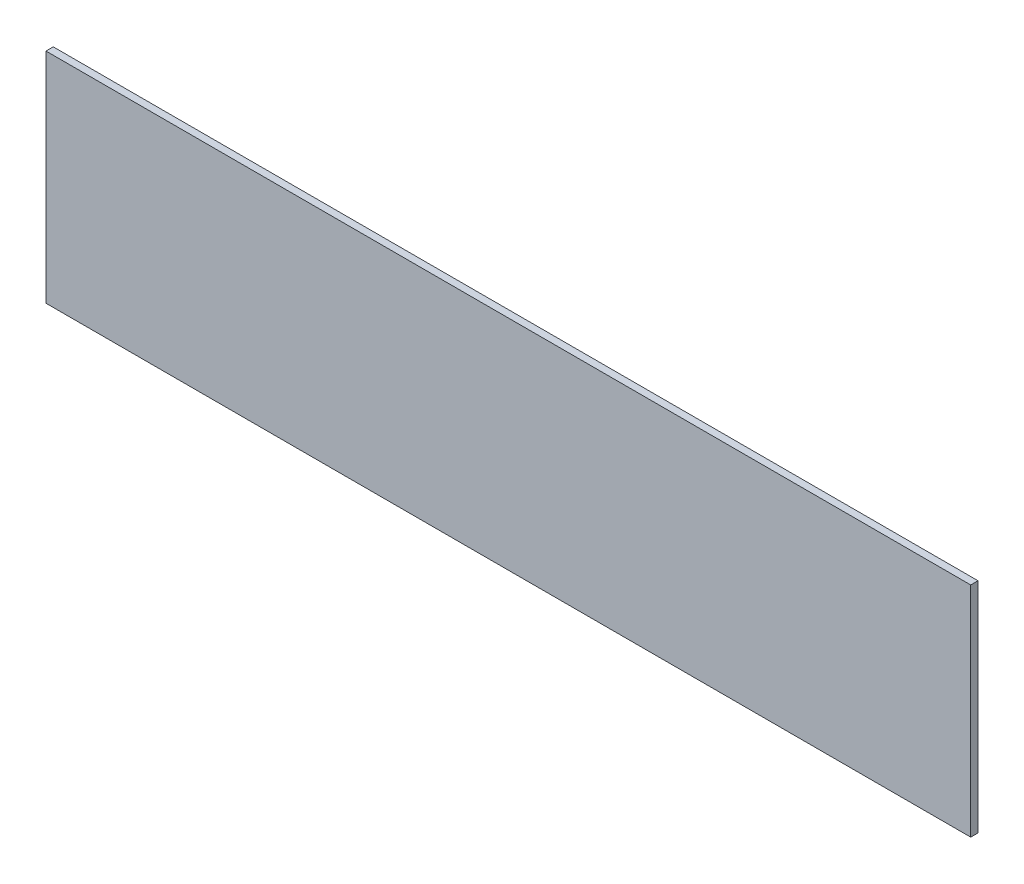
ISO-10303-21;
HEADER;
FILE_DESCRIPTION(('STEP AP214'),'2;1');
FILE_NAME('part.step','',(''),(''),'','','');
FILE_SCHEMA(('AUTOMOTIVE_DESIGN { 1 0 10303 214 1 1 1 1 }'));
ENDSEC;
DATA;
#1=APPLICATION_CONTEXT('core data for automotive mechanical design processes');
#2=APPLICATION_PROTOCOL_DEFINITION('international standard','automotive_design',2000,#1);
#3=PRODUCT_CONTEXT('',#1,'mechanical');
#4=PRODUCT('Part','Part','',(#3));
#5=PRODUCT_RELATED_PRODUCT_CATEGORY('part','',(#4));
#6=PRODUCT_DEFINITION_FORMATION('','',#4);
#7=PRODUCT_DEFINITION_CONTEXT('part definition',#1,'design');
#8=PRODUCT_DEFINITION('design','',#6,#7);
#9=PRODUCT_DEFINITION_SHAPE('','',#8);
#10=(LENGTH_UNIT() NAMED_UNIT(*) SI_UNIT(.MILLI.,.METRE.));
#11=(NAMED_UNIT(*) PLANE_ANGLE_UNIT() SI_UNIT($,.RADIAN.));
#12=(NAMED_UNIT(*) SI_UNIT($,.STERADIAN.) SOLID_ANGLE_UNIT());
#13=UNCERTAINTY_MEASURE_WITH_UNIT(LENGTH_MEASURE(1.E-05),#10,'distance_accuracy_value','');
#14=(GEOMETRIC_REPRESENTATION_CONTEXT(3) GLOBAL_UNCERTAINTY_ASSIGNED_CONTEXT((#13)) GLOBAL_UNIT_ASSIGNED_CONTEXT((#10,
#11,#12)) REPRESENTATION_CONTEXT('',''));
#15=CARTESIAN_POINT('',(0.,0.,0.));
#16=DIRECTION('',(0.,0.,1.));
#17=DIRECTION('',(1.,0.,0.));
#18=AXIS2_PLACEMENT_3D('',#15,#16,#17);
#19=CARTESIAN_POINT('',(-95.25,-22.5,1.5));
#20=DIRECTION('',(1.,0.,0.));
#21=DIRECTION('',(0.,0.,-1.));
#22=AXIS2_PLACEMENT_3D('',#19,#20,#21);
#23=PLANE('',#22);
#24=DIRECTION('',(0.,-1.,0.));
#25=VECTOR('',#24,1.);
#26=CARTESIAN_POINT('',(-95.25,-22.5,0.));
#27=LINE('',#26,#25);
#28=CARTESIAN_POINT('',(-95.25,22.5,0.));
#29=VERTEX_POINT('',#28);
#30=CARTESIAN_POINT('',(-95.25,-22.5,0.));
#31=VERTEX_POINT('',#30);
#32=EDGE_CURVE('E96',#29,#31,#27,.T.);
#33=ORIENTED_EDGE('',*,*,#32,.T.);
#34=DIRECTION('',(0.,0.,-1.));
#35=VECTOR('',#34,1.);
#36=CARTESIAN_POINT('',(-95.25,-22.5,1.5));
#37=LINE('',#36,#35);
#38=CARTESIAN_POINT('',(-95.25,-22.5,1.5));
#39=VERTEX_POINT('',#38);
#40=EDGE_CURVE('E11',#39,#31,#37,.T.);
#41=ORIENTED_EDGE('',*,*,#40,.F.);
#42=DIRECTION('',(0.,-1.,0.));
#43=VECTOR('',#42,1.);
#44=CARTESIAN_POINT('',(-95.25,-22.5,1.5));
#45=LINE('',#44,#43);
#46=CARTESIAN_POINT('',(-95.25,22.5,1.5));
#47=VERTEX_POINT('',#46);
#48=EDGE_CURVE('E84',#47,#39,#45,.T.);
#49=ORIENTED_EDGE('',*,*,#48,.F.);
#50=DIRECTION('',(0.,0.,-1.));
#51=VECTOR('',#50,1.);
#52=CARTESIAN_POINT('',(-95.25,22.5,1.5));
#53=LINE('',#52,#51);
#54=EDGE_CURVE('E92',#47,#29,#53,.T.);
#55=ORIENTED_EDGE('',*,*,#54,.T.);
#56=EDGE_LOOP('',(#33,#41,#49,#55));
#57=FACE_BOUND('',#56,.T.);
#58=ADVANCED_FACE('F33',(#57),#23,.F.);
#59=CARTESIAN_POINT('',(95.25,-22.5,1.5));
#60=DIRECTION('',(0.,1.,0.));
#61=DIRECTION('',(-1.,0.,0.));
#62=AXIS2_PLACEMENT_3D('',#59,#60,#61);
#63=PLANE('',#62);
#64=DIRECTION('',(1.,0.,0.));
#65=VECTOR('',#64,1.);
#66=CARTESIAN_POINT('',(95.25,-22.5,0.));
#67=LINE('',#66,#65);
#68=CARTESIAN_POINT('',(95.25,-22.5,0.));
#69=VERTEX_POINT('',#68);
#70=EDGE_CURVE('E88',#31,#69,#67,.T.);
#71=ORIENTED_EDGE('',*,*,#70,.T.);
#72=DIRECTION('',(0.,0.,-1.));
#73=VECTOR('',#72,1.);
#74=CARTESIAN_POINT('',(95.25,-22.5,1.5));
#75=LINE('',#74,#73);
#76=CARTESIAN_POINT('',(95.25,-22.5,1.5));
#77=VERTEX_POINT('',#76);
#78=EDGE_CURVE('E41',#77,#69,#75,.T.);
#79=ORIENTED_EDGE('',*,*,#78,.F.);
#80=DIRECTION('',(1.,0.,0.));
#81=VECTOR('',#80,1.);
#82=CARTESIAN_POINT('',(95.25,-22.5,1.5));
#83=LINE('',#82,#81);
#84=EDGE_CURVE('E79',#39,#77,#83,.T.);
#85=ORIENTED_EDGE('',*,*,#84,.F.);
#86=ORIENTED_EDGE('',*,*,#40,.T.);
#87=EDGE_LOOP('',(#71,#79,#85,#86));
#88=FACE_BOUND('',#87,.T.);
#89=ADVANCED_FACE('F87',(#88),#63,.F.);
#90=CARTESIAN_POINT('',(95.25,-22.5,1.5));
#91=DIRECTION('',(-1.,0.,0.));
#92=DIRECTION('',(0.,0.,1.));
#93=AXIS2_PLACEMENT_3D('',#90,#91,#92);
#94=PLANE('',#93);
#95=DIRECTION('',(0.,1.,0.));
#96=VECTOR('',#95,1.);
#97=CARTESIAN_POINT('',(95.25,-22.5,0.));
#98=LINE('',#97,#96);
#99=CARTESIAN_POINT('',(95.25,22.5,0.));
#100=VERTEX_POINT('',#99);
#101=EDGE_CURVE('E66',#69,#100,#98,.T.);
#102=ORIENTED_EDGE('',*,*,#101,.T.);
#103=DIRECTION('',(0.,0.,-1.));
#104=VECTOR('',#103,1.);
#105=CARTESIAN_POINT('',(95.25,22.5,1.5));
#106=LINE('',#105,#104);
#107=CARTESIAN_POINT('',(95.25,22.5,1.5));
#108=VERTEX_POINT('',#107);
#109=EDGE_CURVE('E89',#108,#100,#106,.T.);
#110=ORIENTED_EDGE('',*,*,#109,.F.);
#111=DIRECTION('',(0.,1.,0.));
#112=VECTOR('',#111,1.);
#113=CARTESIAN_POINT('',(95.25,-22.5,1.5));
#114=LINE('',#113,#112);
#115=EDGE_CURVE('E82',#77,#108,#114,.T.);
#116=ORIENTED_EDGE('',*,*,#115,.F.);
#117=ORIENTED_EDGE('',*,*,#78,.T.);
#118=EDGE_LOOP('',(#102,#110,#116,#117));
#119=FACE_BOUND('',#118,.T.);
#120=ADVANCED_FACE('F90',(#119),#94,.F.);
#121=CARTESIAN_POINT('',(95.25,22.5,1.5));
#122=DIRECTION('',(0.,-1.,0.));
#123=DIRECTION('',(1.,0.,0.));
#124=AXIS2_PLACEMENT_3D('',#121,#122,#123);
#125=PLANE('',#124);
#126=DIRECTION('',(-1.,0.,0.));
#127=VECTOR('',#126,1.);
#128=CARTESIAN_POINT('',(95.25,22.5,0.));
#129=LINE('',#128,#127);
#130=EDGE_CURVE('E72',#100,#29,#129,.T.);
#131=ORIENTED_EDGE('',*,*,#130,.T.);
#132=ORIENTED_EDGE('',*,*,#54,.F.);
#133=DIRECTION('',(-1.,0.,0.));
#134=VECTOR('',#133,1.);
#135=CARTESIAN_POINT('',(95.25,22.5,1.5));
#136=LINE('',#135,#134);
#137=EDGE_CURVE('E49',#108,#47,#136,.T.);
#138=ORIENTED_EDGE('',*,*,#137,.F.);
#139=ORIENTED_EDGE('',*,*,#109,.T.);
#140=EDGE_LOOP('',(#131,#132,#138,#139));
#141=FACE_BOUND('',#140,.T.);
#142=ADVANCED_FACE('F103',(#141),#125,.F.);
#143=CARTESIAN_POINT('',(0.,0.,1.5));
#144=DIRECTION('',(0.,0.,1.));
#145=DIRECTION('',(1.,0.,0.));
#146=AXIS2_PLACEMENT_3D('',#143,#144,#145);
#147=PLANE('',#146);
#148=ORIENTED_EDGE('',*,*,#48,.T.);
#149=ORIENTED_EDGE('',*,*,#84,.T.);
#150=ORIENTED_EDGE('',*,*,#115,.T.);
#151=ORIENTED_EDGE('',*,*,#137,.T.);
#152=EDGE_LOOP('',(#148,#149,#150,#151));
#153=FACE_BOUND('',#152,.T.);
#154=ADVANCED_FACE('F80',(#153),#147,.T.);
#155=CARTESIAN_POINT('',(0.,0.,0.));
#156=DIRECTION('',(0.,0.,1.));
#157=DIRECTION('',(1.,0.,0.));
#158=AXIS2_PLACEMENT_3D('',#155,#156,#157);
#159=PLANE('',#158);
#160=ORIENTED_EDGE('',*,*,#32,.F.);
#161=ORIENTED_EDGE('',*,*,#130,.F.);
#162=ORIENTED_EDGE('',*,*,#101,.F.);
#163=ORIENTED_EDGE('',*,*,#70,.F.);
#164=EDGE_LOOP('',(#160,#161,#162,#163));
#165=FACE_BOUND('',#164,.T.);
#166=ADVANCED_FACE('F106',(#165),#159,.F.);
#167=CLOSED_SHELL('',(#58,#89,#120,#142,#154,#166));
#168=MANIFOLD_SOLID_BREP('B2',#167);
#169=ADVANCED_BREP_SHAPE_REPRESENTATION('',(#18,#168),#14);
#170=SHAPE_DEFINITION_REPRESENTATION(#9,#169);
ENDSEC;
END-ISO-10303-21;
